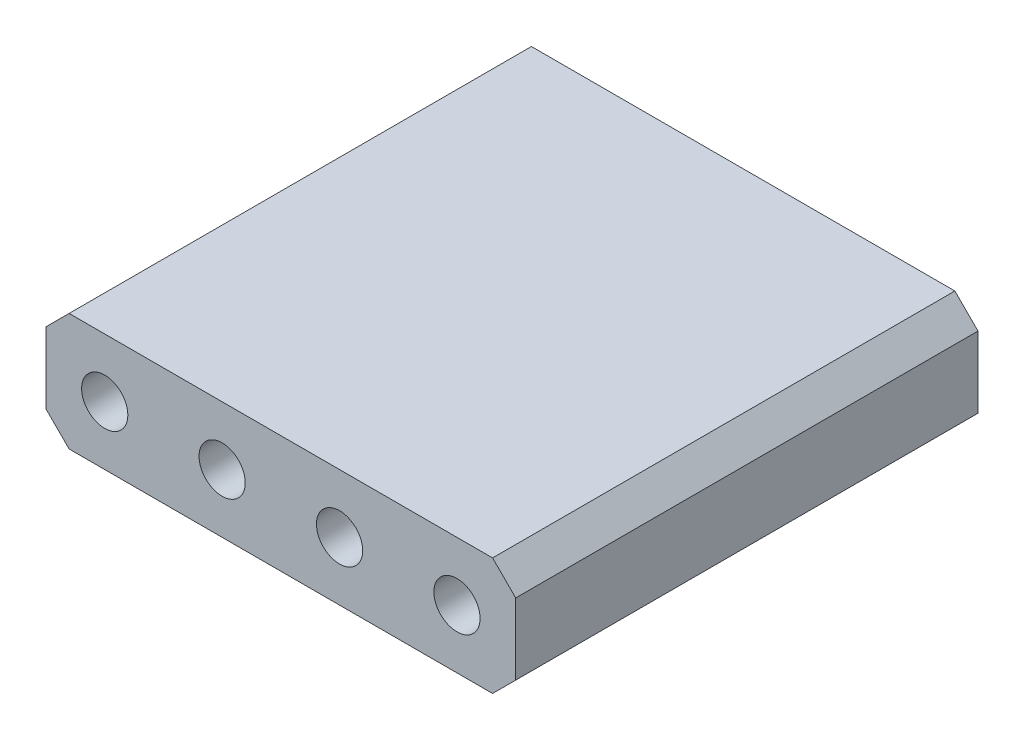
ISO-10303-21;
HEADER;
FILE_DESCRIPTION(('STEP AP214'),'2;1');
FILE_NAME('part.step','',(''),(''),'','','');
FILE_SCHEMA(('AUTOMOTIVE_DESIGN { 1 0 10303 214 1 1 1 1 }'));
ENDSEC;
DATA;
#1=APPLICATION_CONTEXT('core data for automotive mechanical design processes');
#2=APPLICATION_PROTOCOL_DEFINITION('international standard','automotive_design',2000,#1);
#3=PRODUCT_CONTEXT('',#1,'mechanical');
#4=PRODUCT('Part','Part','',(#3));
#5=PRODUCT_RELATED_PRODUCT_CATEGORY('part','',(#4));
#6=PRODUCT_DEFINITION_FORMATION('','',#4);
#7=PRODUCT_DEFINITION_CONTEXT('part definition',#1,'design');
#8=PRODUCT_DEFINITION('design','',#6,#7);
#9=PRODUCT_DEFINITION_SHAPE('','',#8);
#10=(LENGTH_UNIT() NAMED_UNIT(*) SI_UNIT(.MILLI.,.METRE.));
#11=(NAMED_UNIT(*) PLANE_ANGLE_UNIT() SI_UNIT($,.RADIAN.));
#12=(NAMED_UNIT(*) SI_UNIT($,.STERADIAN.) SOLID_ANGLE_UNIT());
#13=UNCERTAINTY_MEASURE_WITH_UNIT(LENGTH_MEASURE(1.E-05),#10,'distance_accuracy_value','');
#14=(GEOMETRIC_REPRESENTATION_CONTEXT(3) GLOBAL_UNCERTAINTY_ASSIGNED_CONTEXT((#13)) GLOBAL_UNIT_ASSIGNED_CONTEXT((#10,
#11,#12)) REPRESENTATION_CONTEXT('',''));
#15=CARTESIAN_POINT('',(0.,0.,0.));
#16=DIRECTION('',(0.,0.,1.));
#17=DIRECTION('',(1.,0.,0.));
#18=AXIS2_PLACEMENT_3D('',#15,#16,#17);
#19=CARTESIAN_POINT('',(0.,0.,10.));
#20=DIRECTION('',(0.,0.,-1.));
#21=DIRECTION('',(-1.,0.,0.));
#22=AXIS2_PLACEMENT_3D('',#19,#20,#21);
#23=PLANE('',#22);
#24=DIRECTION('',(-1.,0.,0.));
#25=VECTOR('',#24,1.);
#26=CARTESIAN_POINT('',(-5.08,1.27,10.));
#27=LINE('',#26,#25);
#28=CARTESIAN_POINT('',(4.58,1.27,10.));
#29=VERTEX_POINT('',#28);
#30=CARTESIAN_POINT('',(-4.58,1.27,10.));
#31=VERTEX_POINT('',#30);
#32=EDGE_CURVE('E171',#29,#31,#27,.T.);
#33=ORIENTED_EDGE('',*,*,#32,.T.);
#34=DIRECTION('',(0.707106781186549,0.707106781186546,0.));
#35=VECTOR('',#34,1.);
#36=CARTESIAN_POINT('',(-5.08,0.769999999999995,10.));
#37=LINE('',#36,#35);
#38=CARTESIAN_POINT('',(-5.08,0.769999999999995,10.));
#39=VERTEX_POINT('',#38);
#40=EDGE_CURVE('E149',#31,#39,#37,.F.);
#41=ORIENTED_EDGE('',*,*,#40,.T.);
#42=DIRECTION('',(0.,-1.,0.));
#43=VECTOR('',#42,1.);
#44=CARTESIAN_POINT('',(-5.08,-1.27,10.));
#45=LINE('',#44,#43);
#46=CARTESIAN_POINT('',(-5.08,-0.77,10.));
#47=VERTEX_POINT('',#46);
#48=EDGE_CURVE('E119',#39,#47,#45,.T.);
#49=ORIENTED_EDGE('',*,*,#48,.T.);
#50=DIRECTION('',(-0.707106781186546,0.707106781186549,0.));
#51=VECTOR('',#50,1.);
#52=CARTESIAN_POINT('',(-4.58,-1.27,10.));
#53=LINE('',#52,#51);
#54=CARTESIAN_POINT('',(-4.58,-1.27,10.));
#55=VERTEX_POINT('',#54);
#56=EDGE_CURVE('E55',#47,#55,#53,.F.);
#57=ORIENTED_EDGE('',*,*,#56,.T.);
#58=DIRECTION('',(1.,0.,0.));
#59=VECTOR('',#58,1.);
#60=CARTESIAN_POINT('',(-5.08,-1.27,10.));
#61=LINE('',#60,#59);
#62=CARTESIAN_POINT('',(4.58,-1.27,10.));
#63=VERTEX_POINT('',#62);
#64=EDGE_CURVE('E135',#55,#63,#61,.T.);
#65=ORIENTED_EDGE('',*,*,#64,.T.);
#66=DIRECTION('',(-0.707106781186549,-0.707106781186546,0.));
#67=VECTOR('',#66,1.);
#68=CARTESIAN_POINT('',(5.08,-0.770000000000002,10.));
#69=LINE('',#68,#67);
#70=CARTESIAN_POINT('',(5.08,-0.770000000000002,10.));
#71=VERTEX_POINT('',#70);
#72=EDGE_CURVE('E145',#63,#71,#69,.F.);
#73=ORIENTED_EDGE('',*,*,#72,.T.);
#74=DIRECTION('',(0.,1.,0.));
#75=VECTOR('',#74,1.);
#76=CARTESIAN_POINT('',(5.08,-1.27,10.));
#77=LINE('',#76,#75);
#78=CARTESIAN_POINT('',(5.08,0.769999999999993,10.));
#79=VERTEX_POINT('',#78);
#80=EDGE_CURVE('E129',#71,#79,#77,.T.);
#81=ORIENTED_EDGE('',*,*,#80,.T.);
#82=DIRECTION('',(0.707106781186546,-0.707106781186549,0.));
#83=VECTOR('',#82,1.);
#84=CARTESIAN_POINT('',(4.58,1.27,10.));
#85=LINE('',#84,#83);
#86=EDGE_CURVE('E147',#79,#29,#85,.F.);
#87=ORIENTED_EDGE('',*,*,#86,.T.);
#88=EDGE_LOOP('',(#33,#41,#49,#57,#65,#73,#81,#87));
#89=FACE_BOUND('',#88,.T.);
#90=CARTESIAN_POINT('',(-3.81,0.,10.));
#91=DIRECTION('',(0.,0.,1.));
#92=DIRECTION('',(1.,0.,0.));
#93=AXIS2_PLACEMENT_3D('',#90,#91,#92);
#94=CIRCLE('',#93,0.5);
#95=CARTESIAN_POINT('',(-3.31,0.,10.));
#96=VERTEX_POINT('',#95);
#97=EDGE_CURVE('E180',#96,#96,#94,.T.);
#98=ORIENTED_EDGE('',*,*,#97,.F.);
#99=EDGE_LOOP('',(#98));
#100=FACE_BOUND('',#99,.T.);
#101=CARTESIAN_POINT('',(-1.27,0.,10.));
#102=DIRECTION('',(0.,0.,1.));
#103=DIRECTION('',(1.,0.,0.));
#104=AXIS2_PLACEMENT_3D('',#101,#102,#103);
#105=CIRCLE('',#104,0.5);
#106=CARTESIAN_POINT('',(-0.769999999999999,0.,10.));
#107=VERTEX_POINT('',#106);
#108=EDGE_CURVE('E185',#107,#107,#105,.T.);
#109=ORIENTED_EDGE('',*,*,#108,.F.);
#110=EDGE_LOOP('',(#109));
#111=FACE_BOUND('',#110,.T.);
#112=CARTESIAN_POINT('',(1.27,0.,10.));
#113=DIRECTION('',(0.,0.,1.));
#114=DIRECTION('',(1.,0.,0.));
#115=AXIS2_PLACEMENT_3D('',#112,#113,#114);
#116=CIRCLE('',#115,0.5);
#117=CARTESIAN_POINT('',(1.77,0.,10.));
#118=VERTEX_POINT('',#117);
#119=EDGE_CURVE('E190',#118,#118,#116,.T.);
#120=ORIENTED_EDGE('',*,*,#119,.F.);
#121=EDGE_LOOP('',(#120));
#122=FACE_BOUND('',#121,.T.);
#123=CARTESIAN_POINT('',(3.81,0.,10.));
#124=DIRECTION('',(0.,0.,1.));
#125=DIRECTION('',(1.,0.,0.));
#126=AXIS2_PLACEMENT_3D('',#123,#124,#125);
#127=CIRCLE('',#126,0.5);
#128=CARTESIAN_POINT('',(4.31,0.,10.));
#129=VERTEX_POINT('',#128);
#130=EDGE_CURVE('E196',#129,#129,#127,.T.);
#131=ORIENTED_EDGE('',*,*,#130,.F.);
#132=EDGE_LOOP('',(#131));
#133=FACE_BOUND('',#132,.T.);
#134=ADVANCED_FACE('F35',(#89,#100,#111,#122,#133),#23,.F.);
#135=CARTESIAN_POINT('',(0.,0.,0.));
#136=DIRECTION('',(0.,0.,-1.));
#137=DIRECTION('',(-1.,0.,0.));
#138=AXIS2_PLACEMENT_3D('',#135,#136,#137);
#139=PLANE('',#138);
#140=CARTESIAN_POINT('',(1.27,0.,0.));
#141=DIRECTION('',(0.,0.,1.));
#142=DIRECTION('',(1.,0.,0.));
#143=AXIS2_PLACEMENT_3D('',#140,#141,#142);
#144=CIRCLE('',#143,0.5);
#145=CARTESIAN_POINT('',(1.77,0.,0.));
#146=VERTEX_POINT('',#145);
#147=EDGE_CURVE('E193',#146,#146,#144,.T.);
#148=ORIENTED_EDGE('',*,*,#147,.T.);
#149=EDGE_LOOP('',(#148));
#150=FACE_BOUND('',#149,.T.);
#151=CARTESIAN_POINT('',(-3.81,0.,0.));
#152=DIRECTION('',(0.,0.,1.));
#153=DIRECTION('',(1.,0.,0.));
#154=AXIS2_PLACEMENT_3D('',#151,#152,#153);
#155=CIRCLE('',#154,0.5);
#156=CARTESIAN_POINT('',(-3.31,0.,0.));
#157=VERTEX_POINT('',#156);
#158=EDGE_CURVE('E176',#157,#157,#155,.T.);
#159=ORIENTED_EDGE('',*,*,#158,.T.);
#160=EDGE_LOOP('',(#159));
#161=FACE_BOUND('',#160,.T.);
#162=DIRECTION('',(0.,-1.,0.));
#163=VECTOR('',#162,1.);
#164=CARTESIAN_POINT('',(-5.08,-1.27,0.));
#165=LINE('',#164,#163);
#166=CARTESIAN_POINT('',(-5.08,0.769999999999995,0.));
#167=VERTEX_POINT('',#166);
#168=CARTESIAN_POINT('',(-5.08,-0.77,0.));
#169=VERTEX_POINT('',#168);
#170=EDGE_CURVE('E117',#167,#169,#165,.T.);
#171=ORIENTED_EDGE('',*,*,#170,.F.);
#172=DIRECTION('',(-0.707106781186549,-0.707106781186546,0.));
#173=VECTOR('',#172,1.);
#174=CARTESIAN_POINT('',(-2.92499999999999,2.925,0.));
#175=LINE('',#174,#173);
#176=CARTESIAN_POINT('',(-4.58,1.27,0.));
#177=VERTEX_POINT('',#176);
#178=EDGE_CURVE('E100',#167,#177,#175,.F.);
#179=ORIENTED_EDGE('',*,*,#178,.T.);
#180=DIRECTION('',(-1.,0.,0.));
#181=VECTOR('',#180,1.);
#182=CARTESIAN_POINT('',(-5.08,1.27,0.));
#183=LINE('',#182,#181);
#184=CARTESIAN_POINT('',(4.58,1.27,0.));
#185=VERTEX_POINT('',#184);
#186=EDGE_CURVE('E127',#185,#177,#183,.T.);
#187=ORIENTED_EDGE('',*,*,#186,.F.);
#188=DIRECTION('',(-0.707106781186546,0.707106781186549,0.));
#189=VECTOR('',#188,1.);
#190=CARTESIAN_POINT('',(2.92500000000001,2.925,0.));
#191=LINE('',#190,#189);
#192=CARTESIAN_POINT('',(5.08,0.769999999999993,0.));
#193=VERTEX_POINT('',#192);
#194=EDGE_CURVE('E111',#185,#193,#191,.F.);
#195=ORIENTED_EDGE('',*,*,#194,.T.);
#196=DIRECTION('',(0.,1.,0.));
#197=VECTOR('',#196,1.);
#198=CARTESIAN_POINT('',(5.08,-1.27,0.));
#199=LINE('',#198,#197);
#200=CARTESIAN_POINT('',(5.08,-0.770000000000002,0.));
#201=VERTEX_POINT('',#200);
#202=EDGE_CURVE('E131',#201,#193,#199,.T.);
#203=ORIENTED_EDGE('',*,*,#202,.F.);
#204=DIRECTION('',(0.707106781186549,0.707106781186546,0.));
#205=VECTOR('',#204,1.);
#206=CARTESIAN_POINT('',(2.92499999999999,-2.925,0.));
#207=LINE('',#206,#205);
#208=CARTESIAN_POINT('',(4.58,-1.27,0.));
#209=VERTEX_POINT('',#208);
#210=EDGE_CURVE('E138',#201,#209,#207,.F.);
#211=ORIENTED_EDGE('',*,*,#210,.T.);
#212=DIRECTION('',(1.,0.,0.));
#213=VECTOR('',#212,1.);
#214=CARTESIAN_POINT('',(-5.08,-1.27,0.));
#215=LINE('',#214,#213);
#216=CARTESIAN_POINT('',(-4.58,-1.27,0.));
#217=VERTEX_POINT('',#216);
#218=EDGE_CURVE('E126',#217,#209,#215,.T.);
#219=ORIENTED_EDGE('',*,*,#218,.F.);
#220=DIRECTION('',(0.707106781186546,-0.707106781186549,0.));
#221=VECTOR('',#220,1.);
#222=CARTESIAN_POINT('',(-2.92500000000001,-2.925,0.));
#223=LINE('',#222,#221);
#224=EDGE_CURVE('E120',#217,#169,#223,.F.);
#225=ORIENTED_EDGE('',*,*,#224,.T.);
#226=EDGE_LOOP('',(#171,#179,#187,#195,#203,#211,#219,#225));
#227=FACE_BOUND('',#226,.T.);
#228=CARTESIAN_POINT('',(-1.27,0.,0.));
#229=DIRECTION('',(0.,0.,1.));
#230=DIRECTION('',(1.,0.,0.));
#231=AXIS2_PLACEMENT_3D('',#228,#229,#230);
#232=CIRCLE('',#231,0.5);
#233=CARTESIAN_POINT('',(-0.769999999999999,0.,0.));
#234=VERTEX_POINT('',#233);
#235=EDGE_CURVE('E187',#234,#234,#232,.T.);
#236=ORIENTED_EDGE('',*,*,#235,.T.);
#237=EDGE_LOOP('',(#236));
#238=FACE_BOUND('',#237,.T.);
#239=CARTESIAN_POINT('',(3.81,0.,0.));
#240=DIRECTION('',(0.,0.,1.));
#241=DIRECTION('',(1.,0.,0.));
#242=AXIS2_PLACEMENT_3D('',#239,#240,#241);
#243=CIRCLE('',#242,0.5);
#244=CARTESIAN_POINT('',(4.31,0.,0.));
#245=VERTEX_POINT('',#244);
#246=EDGE_CURVE('E199',#245,#245,#243,.T.);
#247=ORIENTED_EDGE('',*,*,#246,.T.);
#248=EDGE_LOOP('',(#247));
#249=FACE_BOUND('',#248,.T.);
#250=ADVANCED_FACE('F123',(#150,#161,#227,#238,#249),#139,.T.);
#251=CARTESIAN_POINT('',(5.08,-1.27,10.));
#252=DIRECTION('',(-1.,0.,0.));
#253=DIRECTION('',(0.,0.,1.));
#254=AXIS2_PLACEMENT_3D('',#251,#252,#253);
#255=PLANE('',#254);
#256=ORIENTED_EDGE('',*,*,#202,.T.);
#257=DIRECTION('',(0.,0.,1.));
#258=VECTOR('',#257,1.);
#259=CARTESIAN_POINT('',(5.08,0.769999999999993,10.));
#260=LINE('',#259,#258);
#261=EDGE_CURVE('E154',#193,#79,#260,.T.);
#262=ORIENTED_EDGE('',*,*,#261,.T.);
#263=ORIENTED_EDGE('',*,*,#80,.F.);
#264=DIRECTION('',(0.,0.,-1.));
#265=VECTOR('',#264,1.);
#266=CARTESIAN_POINT('',(5.08,-0.770000000000002,10.));
#267=LINE('',#266,#265);
#268=EDGE_CURVE('E151',#71,#201,#267,.T.);
#269=ORIENTED_EDGE('',*,*,#268,.T.);
#270=EDGE_LOOP('',(#256,#262,#263,#269));
#271=FACE_BOUND('',#270,.T.);
#272=ADVANCED_FACE('F167',(#271),#255,.F.);
#273=CARTESIAN_POINT('',(-5.08,1.27,10.));
#274=DIRECTION('',(0.,-1.,0.));
#275=DIRECTION('',(0.,0.,-1.));
#276=AXIS2_PLACEMENT_3D('',#273,#274,#275);
#277=PLANE('',#276);
#278=ORIENTED_EDGE('',*,*,#186,.T.);
#279=DIRECTION('',(0.,0.,1.));
#280=VECTOR('',#279,1.);
#281=CARTESIAN_POINT('',(-4.58,1.27,10.));
#282=LINE('',#281,#280);
#283=EDGE_CURVE('E105',#177,#31,#282,.T.);
#284=ORIENTED_EDGE('',*,*,#283,.T.);
#285=ORIENTED_EDGE('',*,*,#32,.F.);
#286=DIRECTION('',(0.,0.,-1.));
#287=VECTOR('',#286,1.);
#288=CARTESIAN_POINT('',(4.58,1.27,10.));
#289=LINE('',#288,#287);
#290=EDGE_CURVE('E110',#29,#185,#289,.T.);
#291=ORIENTED_EDGE('',*,*,#290,.T.);
#292=EDGE_LOOP('',(#278,#284,#285,#291));
#293=FACE_BOUND('',#292,.T.);
#294=ADVANCED_FACE('F224',(#293),#277,.F.);
#295=CARTESIAN_POINT('',(-5.08,-1.27,10.));
#296=DIRECTION('',(1.,0.,0.));
#297=DIRECTION('',(0.,0.,-1.));
#298=AXIS2_PLACEMENT_3D('',#295,#296,#297);
#299=PLANE('',#298);
#300=ORIENTED_EDGE('',*,*,#48,.F.);
#301=DIRECTION('',(0.,0.,-1.));
#302=VECTOR('',#301,1.);
#303=CARTESIAN_POINT('',(-5.08,0.769999999999995,10.));
#304=LINE('',#303,#302);
#305=EDGE_CURVE('E104',#39,#167,#304,.T.);
#306=ORIENTED_EDGE('',*,*,#305,.T.);
#307=ORIENTED_EDGE('',*,*,#170,.T.);
#308=DIRECTION('',(0.,0.,1.));
#309=VECTOR('',#308,1.);
#310=CARTESIAN_POINT('',(-5.08,-0.77,10.));
#311=LINE('',#310,#309);
#312=EDGE_CURVE('E121',#169,#47,#311,.T.);
#313=ORIENTED_EDGE('',*,*,#312,.T.);
#314=EDGE_LOOP('',(#300,#306,#307,#313));
#315=FACE_BOUND('',#314,.T.);
#316=ADVANCED_FACE('F116',(#315),#299,.F.);
#317=CARTESIAN_POINT('',(-5.08,-1.27,10.));
#318=DIRECTION('',(0.,1.,0.));
#319=DIRECTION('',(0.,0.,1.));
#320=AXIS2_PLACEMENT_3D('',#317,#318,#319);
#321=PLANE('',#320);
#322=ORIENTED_EDGE('',*,*,#218,.T.);
#323=DIRECTION('',(0.,0.,1.));
#324=VECTOR('',#323,1.);
#325=CARTESIAN_POINT('',(4.58,-1.27,10.));
#326=LINE('',#325,#324);
#327=EDGE_CURVE('E11',#209,#63,#326,.T.);
#328=ORIENTED_EDGE('',*,*,#327,.T.);
#329=ORIENTED_EDGE('',*,*,#64,.F.);
#330=DIRECTION('',(0.,0.,-1.));
#331=VECTOR('',#330,1.);
#332=CARTESIAN_POINT('',(-4.58,-1.27,10.));
#333=LINE('',#332,#331);
#334=EDGE_CURVE('E43',#55,#217,#333,.T.);
#335=ORIENTED_EDGE('',*,*,#334,.T.);
#336=EDGE_LOOP('',(#322,#328,#329,#335));
#337=FACE_BOUND('',#336,.T.);
#338=ADVANCED_FACE('F157',(#337),#321,.F.);
#339=CARTESIAN_POINT('',(-3.81,0.,10.));
#340=DIRECTION('',(0.,0.,-1.));
#341=DIRECTION('',(-1.,0.,0.));
#342=AXIS2_PLACEMENT_3D('',#339,#340,#341);
#343=CYLINDRICAL_SURFACE('',#342,0.5);
#344=ORIENTED_EDGE('',*,*,#97,.T.);
#345=EDGE_LOOP('',(#344));
#346=FACE_BOUND('',#345,.T.);
#347=ORIENTED_EDGE('',*,*,#158,.F.);
#348=EDGE_LOOP('',(#347));
#349=FACE_BOUND('',#348,.T.);
#350=ADVANCED_FACE('F217',(#346,#349),#343,.F.);
#351=CARTESIAN_POINT('',(-1.27,0.,10.));
#352=DIRECTION('',(0.,0.,-1.));
#353=DIRECTION('',(-1.,0.,0.));
#354=AXIS2_PLACEMENT_3D('',#351,#352,#353);
#355=CYLINDRICAL_SURFACE('',#354,0.5);
#356=ORIENTED_EDGE('',*,*,#108,.T.);
#357=EDGE_LOOP('',(#356));
#358=FACE_BOUND('',#357,.T.);
#359=ORIENTED_EDGE('',*,*,#235,.F.);
#360=EDGE_LOOP('',(#359));
#361=FACE_BOUND('',#360,.T.);
#362=ADVANCED_FACE('F313',(#358,#361),#355,.F.);
#363=CARTESIAN_POINT('',(1.27,0.,10.));
#364=DIRECTION('',(0.,0.,-1.));
#365=DIRECTION('',(-1.,0.,0.));
#366=AXIS2_PLACEMENT_3D('',#363,#364,#365);
#367=CYLINDRICAL_SURFACE('',#366,0.5);
#368=ORIENTED_EDGE('',*,*,#119,.T.);
#369=EDGE_LOOP('',(#368));
#370=FACE_BOUND('',#369,.T.);
#371=ORIENTED_EDGE('',*,*,#147,.F.);
#372=EDGE_LOOP('',(#371));
#373=FACE_BOUND('',#372,.T.);
#374=ADVANCED_FACE('F304',(#370,#373),#367,.F.);
#375=CARTESIAN_POINT('',(3.81,0.,10.));
#376=DIRECTION('',(0.,0.,-1.));
#377=DIRECTION('',(-1.,0.,0.));
#378=AXIS2_PLACEMENT_3D('',#375,#376,#377);
#379=CYLINDRICAL_SURFACE('',#378,0.5);
#380=ORIENTED_EDGE('',*,*,#130,.T.);
#381=EDGE_LOOP('',(#380));
#382=FACE_BOUND('',#381,.T.);
#383=ORIENTED_EDGE('',*,*,#246,.F.);
#384=EDGE_LOOP('',(#383));
#385=FACE_BOUND('',#384,.T.);
#386=ADVANCED_FACE('F205',(#382,#385),#379,.F.);
#387=CARTESIAN_POINT('',(-5.08,0.769999999999995,10.));
#388=DIRECTION('',(0.707106781186546,-0.707106781186549,0.));
#389=DIRECTION('',(0.,0.,-1.));
#390=AXIS2_PLACEMENT_3D('',#387,#388,#389);
#391=PLANE('',#390);
#392=ORIENTED_EDGE('',*,*,#40,.F.);
#393=ORIENTED_EDGE('',*,*,#283,.F.);
#394=ORIENTED_EDGE('',*,*,#178,.F.);
#395=ORIENTED_EDGE('',*,*,#305,.F.);
#396=EDGE_LOOP('',(#392,#393,#394,#395));
#397=FACE_BOUND('',#396,.T.);
#398=ADVANCED_FACE('F103',(#397),#391,.F.);
#399=CARTESIAN_POINT('',(4.58,1.27,10.));
#400=DIRECTION('',(-0.707106781186549,-0.707106781186546,0.));
#401=DIRECTION('',(0.,0.,-1.));
#402=AXIS2_PLACEMENT_3D('',#399,#400,#401);
#403=PLANE('',#402);
#404=ORIENTED_EDGE('',*,*,#86,.F.);
#405=ORIENTED_EDGE('',*,*,#261,.F.);
#406=ORIENTED_EDGE('',*,*,#194,.F.);
#407=ORIENTED_EDGE('',*,*,#290,.F.);
#408=EDGE_LOOP('',(#404,#405,#406,#407));
#409=FACE_BOUND('',#408,.T.);
#410=ADVANCED_FACE('F232',(#409),#403,.F.);
#411=CARTESIAN_POINT('',(5.08,-0.770000000000002,10.));
#412=DIRECTION('',(-0.707106781186546,0.707106781186549,0.));
#413=DIRECTION('',(0.,0.,-1.));
#414=AXIS2_PLACEMENT_3D('',#411,#412,#413);
#415=PLANE('',#414);
#416=ORIENTED_EDGE('',*,*,#72,.F.);
#417=ORIENTED_EDGE('',*,*,#327,.F.);
#418=ORIENTED_EDGE('',*,*,#210,.F.);
#419=ORIENTED_EDGE('',*,*,#268,.F.);
#420=EDGE_LOOP('',(#416,#417,#418,#419));
#421=FACE_BOUND('',#420,.T.);
#422=ADVANCED_FACE('F164',(#421),#415,.F.);
#423=CARTESIAN_POINT('',(-4.58,-1.27,10.));
#424=DIRECTION('',(0.707106781186549,0.707106781186546,0.));
#425=DIRECTION('',(0.,0.,-1.));
#426=AXIS2_PLACEMENT_3D('',#423,#424,#425);
#427=PLANE('',#426);
#428=ORIENTED_EDGE('',*,*,#56,.F.);
#429=ORIENTED_EDGE('',*,*,#312,.F.);
#430=ORIENTED_EDGE('',*,*,#224,.F.);
#431=ORIENTED_EDGE('',*,*,#334,.F.);
#432=EDGE_LOOP('',(#428,#429,#430,#431));
#433=FACE_BOUND('',#432,.T.);
#434=ADVANCED_FACE('F37',(#433),#427,.F.);
#435=CLOSED_SHELL('',(#134,#250,#272,#294,#316,#338,#350,#362,#374,#386,#398,#410,#422,#434));
#436=MANIFOLD_SOLID_BREP('B2',#435);
#437=ADVANCED_BREP_SHAPE_REPRESENTATION('',(#18,#436),#14);
#438=SHAPE_DEFINITION_REPRESENTATION(#9,#437);
ENDSEC;
END-ISO-10303-21;
